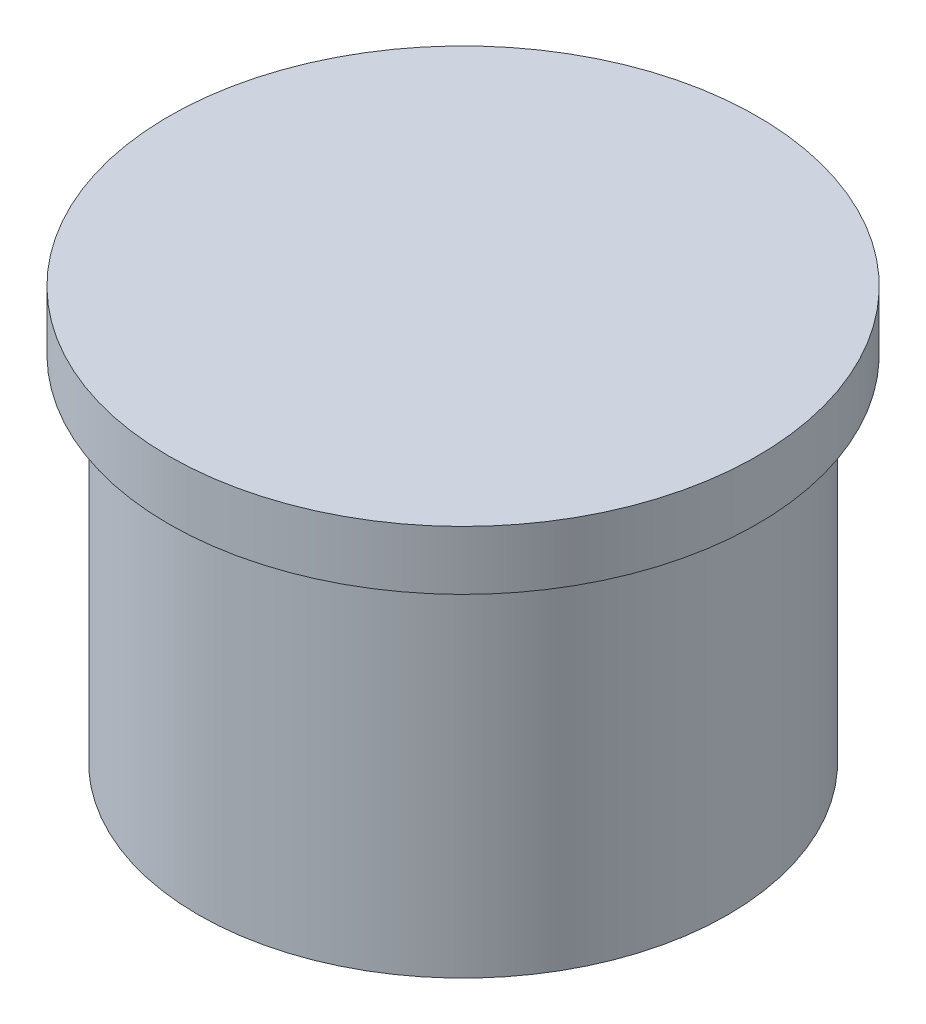
ISO-10303-21;
HEADER;
FILE_DESCRIPTION(('STEP AP214'),'2;1');
FILE_NAME('part.step','',(''),(''),'','','');
FILE_SCHEMA(('AUTOMOTIVE_DESIGN { 1 0 10303 214 1 1 1 1 }'));
ENDSEC;
DATA;
#1=APPLICATION_CONTEXT('core data for automotive mechanical design processes');
#2=APPLICATION_PROTOCOL_DEFINITION('international standard','automotive_design',2000,#1);
#3=PRODUCT_CONTEXT('',#1,'mechanical');
#4=PRODUCT('Part','Part','',(#3));
#5=PRODUCT_RELATED_PRODUCT_CATEGORY('part','',(#4));
#6=PRODUCT_DEFINITION_FORMATION('','',#4);
#7=PRODUCT_DEFINITION_CONTEXT('part definition',#1,'design');
#8=PRODUCT_DEFINITION('design','',#6,#7);
#9=PRODUCT_DEFINITION_SHAPE('','',#8);
#10=(LENGTH_UNIT() NAMED_UNIT(*) SI_UNIT(.MILLI.,.METRE.));
#11=(NAMED_UNIT(*) PLANE_ANGLE_UNIT() SI_UNIT($,.RADIAN.));
#12=(NAMED_UNIT(*) SI_UNIT($,.STERADIAN.) SOLID_ANGLE_UNIT());
#13=UNCERTAINTY_MEASURE_WITH_UNIT(LENGTH_MEASURE(1.E-05),#10,'distance_accuracy_value','');
#14=(GEOMETRIC_REPRESENTATION_CONTEXT(3) GLOBAL_UNCERTAINTY_ASSIGNED_CONTEXT((#13)) GLOBAL_UNIT_ASSIGNED_CONTEXT((#10,
#11,#12)) REPRESENTATION_CONTEXT('',''));
#15=CARTESIAN_POINT('',(0.,0.,0.));
#16=DIRECTION('',(0.,0.,1.));
#17=DIRECTION('',(1.,0.,0.));
#18=AXIS2_PLACEMENT_3D('',#15,#16,#17);
#19=CARTESIAN_POINT('',(0.,3.,0.));
#20=DIRECTION('',(0.,-1.,0.));
#21=DIRECTION('',(0.,0.,-1.));
#22=AXIS2_PLACEMENT_3D('',#19,#20,#21);
#23=CYLINDRICAL_SURFACE('',#22,2.25);
#24=CARTESIAN_POINT('',(0.,3.,0.));
#25=DIRECTION('',(0.,1.,0.));
#26=DIRECTION('',(0.,0.,1.));
#27=AXIS2_PLACEMENT_3D('',#24,#25,#26);
#28=CIRCLE('',#27,2.25);
#29=CARTESIAN_POINT('',(0.,3.,2.24999999999997));
#30=VERTEX_POINT('',#29);
#31=EDGE_CURVE('E10',#30,#30,#28,.T.);
#32=ORIENTED_EDGE('',*,*,#31,.F.);
#33=EDGE_LOOP('',(#32));
#34=FACE_BOUND('',#33,.T.);
#35=CARTESIAN_POINT('',(0.,0.,0.));
#36=DIRECTION('',(0.,1.,0.));
#37=DIRECTION('',(0.,0.,1.));
#38=AXIS2_PLACEMENT_3D('',#35,#36,#37);
#39=CIRCLE('',#38,2.25);
#40=CARTESIAN_POINT('',(0.,0.,2.25));
#41=VERTEX_POINT('',#40);
#42=EDGE_CURVE('E37',#41,#41,#39,.T.);
#43=ORIENTED_EDGE('',*,*,#42,.T.);
#44=EDGE_LOOP('',(#43));
#45=FACE_BOUND('',#44,.T.);
#46=ADVANCED_FACE('F34',(#34,#45),#23,.T.);
#47=CARTESIAN_POINT('',(0.,0.,0.));
#48=DIRECTION('',(0.,1.,0.));
#49=DIRECTION('',(0.,0.,1.));
#50=AXIS2_PLACEMENT_3D('',#47,#48,#49);
#51=PLANE('',#50);
#52=ORIENTED_EDGE('',*,*,#42,.F.);
#53=EDGE_LOOP('',(#52));
#54=FACE_BOUND('',#53,.T.);
#55=ADVANCED_FACE('F57',(#54),#51,.F.);
#56=CARTESIAN_POINT('',(0.,3.5,0.));
#57=DIRECTION('',(0.,-1.,0.));
#58=DIRECTION('',(0.,0.,-1.));
#59=AXIS2_PLACEMENT_3D('',#56,#57,#58);
#60=CYLINDRICAL_SURFACE('',#59,2.5);
#61=CARTESIAN_POINT('',(0.,3.5,0.));
#62=DIRECTION('',(0.,1.,0.));
#63=DIRECTION('',(0.,0.,1.));
#64=AXIS2_PLACEMENT_3D('',#61,#62,#63);
#65=CIRCLE('',#64,2.5);
#66=CARTESIAN_POINT('',(0.,3.5,2.49999999999997));
#67=VERTEX_POINT('',#66);
#68=EDGE_CURVE('E44',#67,#67,#65,.T.);
#69=ORIENTED_EDGE('',*,*,#68,.F.);
#70=EDGE_LOOP('',(#69));
#71=FACE_BOUND('',#70,.T.);
#72=CARTESIAN_POINT('',(0.,3.,0.));
#73=DIRECTION('',(0.,1.,0.));
#74=DIRECTION('',(0.,0.,1.));
#75=AXIS2_PLACEMENT_3D('',#72,#73,#74);
#76=CIRCLE('',#75,2.5);
#77=CARTESIAN_POINT('',(0.,3.,2.49999999999997));
#78=VERTEX_POINT('',#77);
#79=EDGE_CURVE('E46',#78,#78,#76,.T.);
#80=ORIENTED_EDGE('',*,*,#79,.T.);
#81=EDGE_LOOP('',(#80));
#82=FACE_BOUND('',#81,.T.);
#83=ADVANCED_FACE('F54',(#71,#82),#60,.T.);
#84=CARTESIAN_POINT('',(0.,3.5,0.));
#85=DIRECTION('',(0.,1.,0.));
#86=DIRECTION('',(0.,0.,1.));
#87=AXIS2_PLACEMENT_3D('',#84,#85,#86);
#88=PLANE('',#87);
#89=ORIENTED_EDGE('',*,*,#68,.T.);
#90=EDGE_LOOP('',(#89));
#91=FACE_BOUND('',#90,.T.);
#92=ADVANCED_FACE('F52',(#91),#88,.T.);
#93=CARTESIAN_POINT('',(0.,3.,0.));
#94=DIRECTION('',(0.,1.,0.));
#95=DIRECTION('',(0.,0.,1.));
#96=AXIS2_PLACEMENT_3D('',#93,#94,#95);
#97=PLANE('',#96);
#98=ORIENTED_EDGE('',*,*,#31,.T.);
#99=EDGE_LOOP('',(#98));
#100=FACE_BOUND('',#99,.T.);
#101=ORIENTED_EDGE('',*,*,#79,.F.);
#102=EDGE_LOOP('',(#101));
#103=FACE_BOUND('',#102,.T.);
#104=ADVANCED_FACE('F61',(#100,#103),#97,.F.);
#105=CLOSED_SHELL('',(#46,#55,#83,#92,#104));
#106=MANIFOLD_SOLID_BREP('B2',#105);
#107=ADVANCED_BREP_SHAPE_REPRESENTATION('',(#18,#106),#14);
#108=SHAPE_DEFINITION_REPRESENTATION(#9,#107);
ENDSEC;
END-ISO-10303-21;
